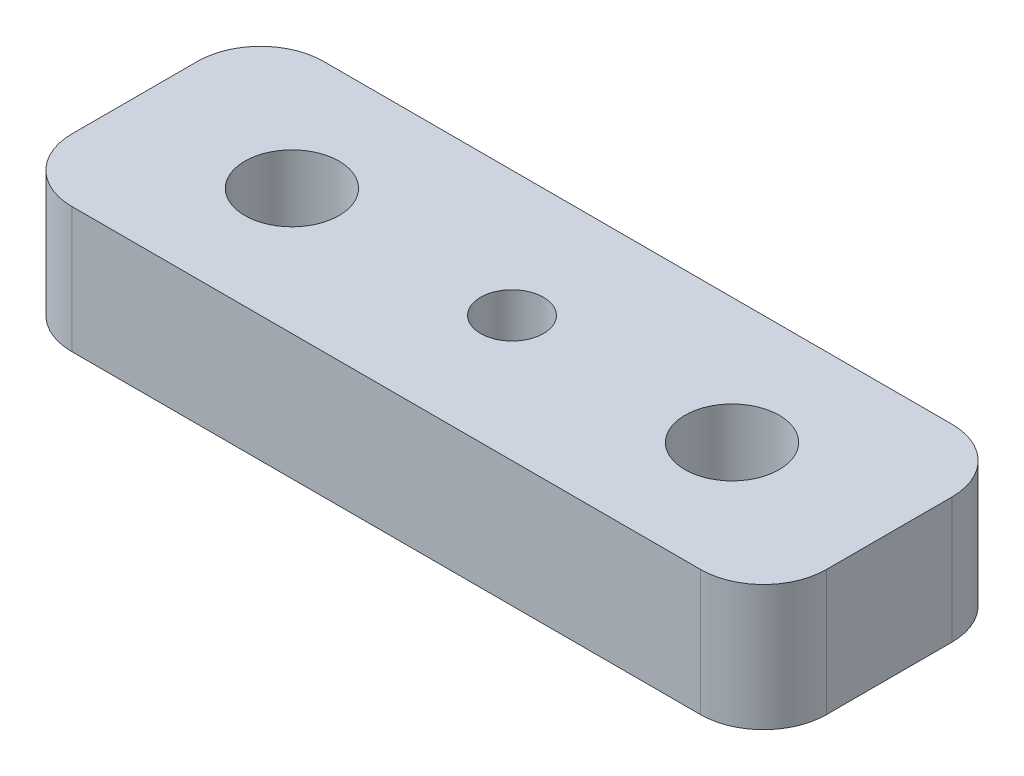
ISO-10303-21;
HEADER;
FILE_DESCRIPTION(('STEP AP214'),'2;1');
FILE_NAME('part.step','',(''),(''),'','','');
FILE_SCHEMA(('AUTOMOTIVE_DESIGN { 1 0 10303 214 1 1 1 1 }'));
ENDSEC;
DATA;
#1=APPLICATION_CONTEXT('core data for automotive mechanical design processes');
#2=APPLICATION_PROTOCOL_DEFINITION('international standard','automotive_design',2000,#1);
#3=PRODUCT_CONTEXT('',#1,'mechanical');
#4=PRODUCT('Part','Part','',(#3));
#5=PRODUCT_RELATED_PRODUCT_CATEGORY('part','',(#4));
#6=PRODUCT_DEFINITION_FORMATION('','',#4);
#7=PRODUCT_DEFINITION_CONTEXT('part definition',#1,'design');
#8=PRODUCT_DEFINITION('design','',#6,#7);
#9=PRODUCT_DEFINITION_SHAPE('','',#8);
#10=(LENGTH_UNIT() NAMED_UNIT(*) SI_UNIT(.MILLI.,.METRE.));
#11=(NAMED_UNIT(*) PLANE_ANGLE_UNIT() SI_UNIT($,.RADIAN.));
#12=(NAMED_UNIT(*) SI_UNIT($,.STERADIAN.) SOLID_ANGLE_UNIT());
#13=UNCERTAINTY_MEASURE_WITH_UNIT(LENGTH_MEASURE(1.E-05),#10,'distance_accuracy_value','');
#14=(GEOMETRIC_REPRESENTATION_CONTEXT(3) GLOBAL_UNCERTAINTY_ASSIGNED_CONTEXT((#13)) GLOBAL_UNIT_ASSIGNED_CONTEXT((#10,
#11,#12)) REPRESENTATION_CONTEXT('',''));
#15=CARTESIAN_POINT('',(0.,0.,0.));
#16=DIRECTION('',(0.,0.,1.));
#17=DIRECTION('',(1.,0.,0.));
#18=AXIS2_PLACEMENT_3D('',#15,#16,#17);
#19=CARTESIAN_POINT('',(-10.,4.,2.));
#20=DIRECTION('',(0.,-1.,0.));
#21=DIRECTION('',(0.,0.,-1.));
#22=AXIS2_PLACEMENT_3D('',#19,#20,#21);
#23=PLANE('',#22);
#24=DIRECTION('',(-1.,0.,0.));
#25=VECTOR('',#24,1.);
#26=CARTESIAN_POINT('',(10.,4.,4.));
#27=LINE('',#26,#25);
#28=CARTESIAN_POINT('',(10.,4.,4.));
#29=VERTEX_POINT('',#28);
#30=CARTESIAN_POINT('',(-10.,4.,4.));
#31=VERTEX_POINT('',#30);
#32=EDGE_CURVE('E88',#29,#31,#27,.T.);
#33=ORIENTED_EDGE('',*,*,#32,.F.);
#34=CARTESIAN_POINT('',(10.,4.,2.));
#35=DIRECTION('',(0.,1.,0.));
#36=DIRECTION('',(0.,0.,1.));
#37=AXIS2_PLACEMENT_3D('',#34,#35,#36);
#38=CIRCLE('',#37,2.);
#39=CARTESIAN_POINT('',(12.,4.,2.));
#40=VERTEX_POINT('',#39);
#41=EDGE_CURVE('E123',#29,#40,#38,.T.);
#42=ORIENTED_EDGE('',*,*,#41,.T.);
#43=DIRECTION('',(0.,0.,1.));
#44=VECTOR('',#43,1.);
#45=CARTESIAN_POINT('',(12.,4.,-2.));
#46=LINE('',#45,#44);
#47=CARTESIAN_POINT('',(12.,4.,-2.));
#48=VERTEX_POINT('',#47);
#49=EDGE_CURVE('E106',#48,#40,#46,.T.);
#50=ORIENTED_EDGE('',*,*,#49,.F.);
#51=CARTESIAN_POINT('',(10.,4.,-2.));
#52=DIRECTION('',(0.,1.,0.));
#53=DIRECTION('',(0.,0.,1.));
#54=AXIS2_PLACEMENT_3D('',#51,#52,#53);
#55=CIRCLE('',#54,2.);
#56=CARTESIAN_POINT('',(10.,4.,-4.));
#57=VERTEX_POINT('',#56);
#58=EDGE_CURVE('E116',#48,#57,#55,.T.);
#59=ORIENTED_EDGE('',*,*,#58,.T.);
#60=DIRECTION('',(1.,0.,0.));
#61=VECTOR('',#60,1.);
#62=CARTESIAN_POINT('',(-10.,4.,-4.));
#63=LINE('',#62,#61);
#64=CARTESIAN_POINT('',(-10.,4.,-4.));
#65=VERTEX_POINT('',#64);
#66=EDGE_CURVE('E120',#65,#57,#63,.T.);
#67=ORIENTED_EDGE('',*,*,#66,.F.);
#68=CARTESIAN_POINT('',(-10.,4.,-2.));
#69=DIRECTION('',(0.,1.,0.));
#70=DIRECTION('',(0.,0.,1.));
#71=AXIS2_PLACEMENT_3D('',#68,#69,#70);
#72=CIRCLE('',#71,2.);
#73=CARTESIAN_POINT('',(-12.,4.,-2.));
#74=VERTEX_POINT('',#73);
#75=EDGE_CURVE('E178',#65,#74,#72,.T.);
#76=ORIENTED_EDGE('',*,*,#75,.T.);
#77=DIRECTION('',(0.,0.,-1.));
#78=VECTOR('',#77,1.);
#79=CARTESIAN_POINT('',(-12.,4.,2.));
#80=LINE('',#79,#78);
#81=CARTESIAN_POINT('',(-12.,4.,2.));
#82=VERTEX_POINT('',#81);
#83=EDGE_CURVE('E171',#82,#74,#80,.T.);
#84=ORIENTED_EDGE('',*,*,#83,.F.);
#85=CARTESIAN_POINT('',(-10.,4.,2.));
#86=DIRECTION('',(0.,-1.,0.));
#87=DIRECTION('',(0.,0.,-1.));
#88=AXIS2_PLACEMENT_3D('',#85,#86,#87);
#89=CIRCLE('',#88,2.);
#90=EDGE_CURVE('E169',#31,#82,#89,.T.);
#91=ORIENTED_EDGE('',*,*,#90,.F.);
#92=EDGE_LOOP('',(#33,#42,#50,#59,#67,#76,#84,#91));
#93=FACE_BOUND('',#92,.T.);
#94=CARTESIAN_POINT('',(0.,4.,0.));
#95=DIRECTION('',(0.,-1.,0.));
#96=DIRECTION('',(0.,0.,-1.));
#97=AXIS2_PLACEMENT_3D('',#94,#95,#96);
#98=CIRCLE('',#97,1.);
#99=CARTESIAN_POINT('',(0.,4.,-1.));
#100=VERTEX_POINT('',#99);
#101=EDGE_CURVE('E131',#100,#100,#98,.T.);
#102=ORIENTED_EDGE('',*,*,#101,.T.);
#103=EDGE_LOOP('',(#102));
#104=FACE_BOUND('',#103,.T.);
#105=CARTESIAN_POINT('',(-7.,4.,0.));
#106=DIRECTION('',(0.,-1.,0.));
#107=DIRECTION('',(0.,0.,-1.));
#108=AXIS2_PLACEMENT_3D('',#105,#106,#107);
#109=CIRCLE('',#108,1.5);
#110=CARTESIAN_POINT('',(-7.,4.,-1.5));
#111=VERTEX_POINT('',#110);
#112=EDGE_CURVE('E312',#111,#111,#109,.T.);
#113=ORIENTED_EDGE('',*,*,#112,.T.);
#114=EDGE_LOOP('',(#113));
#115=FACE_BOUND('',#114,.T.);
#116=CARTESIAN_POINT('',(7.,4.,0.));
#117=DIRECTION('',(0.,-1.,0.));
#118=DIRECTION('',(0.,0.,-1.));
#119=AXIS2_PLACEMENT_3D('',#116,#117,#118);
#120=CIRCLE('',#119,1.5);
#121=CARTESIAN_POINT('',(7.,4.,-1.5));
#122=VERTEX_POINT('',#121);
#123=EDGE_CURVE('E308',#122,#122,#120,.F.);
#124=ORIENTED_EDGE('',*,*,#123,.F.);
#125=EDGE_LOOP('',(#124));
#126=FACE_BOUND('',#125,.T.);
#127=ADVANCED_FACE('F34',(#93,#104,#115,#126),#23,.F.);
#128=CARTESIAN_POINT('',(-10.,0.,2.));
#129=DIRECTION('',(0.,-1.,0.));
#130=DIRECTION('',(0.,0.,-1.));
#131=AXIS2_PLACEMENT_3D('',#128,#129,#130);
#132=PLANE('',#131);
#133=CARTESIAN_POINT('',(0.,0.,0.));
#134=DIRECTION('',(0.,1.,0.));
#135=DIRECTION('',(0.,0.,1.));
#136=AXIS2_PLACEMENT_3D('',#133,#134,#135);
#137=CIRCLE('',#136,2.5);
#138=CARTESIAN_POINT('',(0.,0.,2.5));
#139=VERTEX_POINT('',#138);
#140=EDGE_CURVE('E306',#139,#139,#137,.T.);
#141=ORIENTED_EDGE('',*,*,#140,.T.);
#142=EDGE_LOOP('',(#141));
#143=FACE_BOUND('',#142,.T.);
#144=CARTESIAN_POINT('',(-7.,0.,0.));
#145=DIRECTION('',(0.,1.,0.));
#146=DIRECTION('',(0.,0.,1.));
#147=AXIS2_PLACEMENT_3D('',#144,#145,#146);
#148=CIRCLE('',#147,1.5);
#149=CARTESIAN_POINT('',(-7.,0.,1.5));
#150=VERTEX_POINT('',#149);
#151=EDGE_CURVE('E315',#150,#150,#148,.T.);
#152=ORIENTED_EDGE('',*,*,#151,.T.);
#153=EDGE_LOOP('',(#152));
#154=FACE_BOUND('',#153,.T.);
#155=CARTESIAN_POINT('',(10.,0.,2.));
#156=DIRECTION('',(0.,1.,0.));
#157=DIRECTION('',(0.,0.,1.));
#158=AXIS2_PLACEMENT_3D('',#155,#156,#157);
#159=CIRCLE('',#158,2.);
#160=CARTESIAN_POINT('',(10.,0.,4.));
#161=VERTEX_POINT('',#160);
#162=CARTESIAN_POINT('',(12.,0.,2.));
#163=VERTEX_POINT('',#162);
#164=EDGE_CURVE('E146',#161,#163,#159,.T.);
#165=ORIENTED_EDGE('',*,*,#164,.F.);
#166=DIRECTION('',(-1.,0.,0.));
#167=VECTOR('',#166,1.);
#168=CARTESIAN_POINT('',(0.,0.,4.));
#169=LINE('',#168,#167);
#170=CARTESIAN_POINT('',(-10.,0.,4.));
#171=VERTEX_POINT('',#170);
#172=EDGE_CURVE('E84',#161,#171,#169,.T.);
#173=ORIENTED_EDGE('',*,*,#172,.T.);
#174=CARTESIAN_POINT('',(-10.,0.,2.));
#175=DIRECTION('',(0.,-1.,0.));
#176=DIRECTION('',(0.,0.,-1.));
#177=AXIS2_PLACEMENT_3D('',#174,#175,#176);
#178=CIRCLE('',#177,2.);
#179=CARTESIAN_POINT('',(-12.,0.,2.));
#180=VERTEX_POINT('',#179);
#181=EDGE_CURVE('E130',#171,#180,#178,.T.);
#182=ORIENTED_EDGE('',*,*,#181,.T.);
#183=DIRECTION('',(0.,0.,-1.));
#184=VECTOR('',#183,1.);
#185=CARTESIAN_POINT('',(-12.,0.,2.));
#186=LINE('',#185,#184);
#187=CARTESIAN_POINT('',(-12.,0.,-2.));
#188=VERTEX_POINT('',#187);
#189=EDGE_CURVE('E134',#180,#188,#186,.T.);
#190=ORIENTED_EDGE('',*,*,#189,.T.);
#191=CARTESIAN_POINT('',(-10.,0.,-2.));
#192=DIRECTION('',(0.,1.,0.));
#193=DIRECTION('',(0.,0.,1.));
#194=AXIS2_PLACEMENT_3D('',#191,#192,#193);
#195=CIRCLE('',#194,2.);
#196=CARTESIAN_POINT('',(-10.,0.,-4.));
#197=VERTEX_POINT('',#196);
#198=EDGE_CURVE('E137',#197,#188,#195,.T.);
#199=ORIENTED_EDGE('',*,*,#198,.F.);
#200=DIRECTION('',(1.,0.,0.));
#201=VECTOR('',#200,1.);
#202=CARTESIAN_POINT('',(0.,0.,-4.));
#203=LINE('',#202,#201);
#204=CARTESIAN_POINT('',(10.,0.,-4.));
#205=VERTEX_POINT('',#204);
#206=EDGE_CURVE('E140',#197,#205,#203,.T.);
#207=ORIENTED_EDGE('',*,*,#206,.T.);
#208=CARTESIAN_POINT('',(10.,0.,-2.));
#209=DIRECTION('',(0.,1.,0.));
#210=DIRECTION('',(0.,0.,1.));
#211=AXIS2_PLACEMENT_3D('',#208,#209,#210);
#212=CIRCLE('',#211,2.);
#213=CARTESIAN_POINT('',(12.,0.,-2.));
#214=VERTEX_POINT('',#213);
#215=EDGE_CURVE('E143',#214,#205,#212,.T.);
#216=ORIENTED_EDGE('',*,*,#215,.F.);
#217=DIRECTION('',(0.,0.,1.));
#218=VECTOR('',#217,1.);
#219=CARTESIAN_POINT('',(12.,0.,-2.));
#220=LINE('',#219,#218);
#221=EDGE_CURVE('E108',#214,#163,#220,.T.);
#222=ORIENTED_EDGE('',*,*,#221,.T.);
#223=EDGE_LOOP('',(#165,#173,#182,#190,#199,#207,#216,#222));
#224=FACE_BOUND('',#223,.T.);
#225=CARTESIAN_POINT('',(7.,0.,0.));
#226=DIRECTION('',(0.,-1.,0.));
#227=DIRECTION('',(0.,0.,-1.));
#228=AXIS2_PLACEMENT_3D('',#225,#226,#227);
#229=CIRCLE('',#228,1.5);
#230=CARTESIAN_POINT('',(7.,0.,-1.5));
#231=VERTEX_POINT('',#230);
#232=EDGE_CURVE('E318',#231,#231,#229,.T.);
#233=ORIENTED_EDGE('',*,*,#232,.F.);
#234=EDGE_LOOP('',(#233));
#235=FACE_BOUND('',#234,.T.);
#236=ADVANCED_FACE('F164',(#143,#154,#224,#235),#132,.T.);
#237=CARTESIAN_POINT('',(10.,4.,2.));
#238=DIRECTION('',(0.,-1.,0.));
#239=DIRECTION('',(0.,0.,-1.));
#240=AXIS2_PLACEMENT_3D('',#237,#238,#239);
#241=CYLINDRICAL_SURFACE('',#240,2.);
#242=ORIENTED_EDGE('',*,*,#164,.T.);
#243=DIRECTION('',(0.,-1.,0.));
#244=VECTOR('',#243,1.);
#245=CARTESIAN_POINT('',(12.,4.,2.));
#246=LINE('',#245,#244);
#247=EDGE_CURVE('E44',#40,#163,#246,.T.);
#248=ORIENTED_EDGE('',*,*,#247,.F.);
#249=ORIENTED_EDGE('',*,*,#41,.F.);
#250=DIRECTION('',(0.,-1.,0.));
#251=VECTOR('',#250,1.);
#252=CARTESIAN_POINT('',(10.,4.,4.));
#253=LINE('',#252,#251);
#254=EDGE_CURVE('E11',#29,#161,#253,.T.);
#255=ORIENTED_EDGE('',*,*,#254,.T.);
#256=EDGE_LOOP('',(#242,#248,#249,#255));
#257=FACE_BOUND('',#256,.T.);
#258=ADVANCED_FACE('F167',(#257),#241,.T.);
#259=CARTESIAN_POINT('',(12.,4.,-2.));
#260=DIRECTION('',(1.,0.,0.));
#261=DIRECTION('',(0.,0.,-1.));
#262=AXIS2_PLACEMENT_3D('',#259,#260,#261);
#263=PLANE('',#262);
#264=ORIENTED_EDGE('',*,*,#221,.F.);
#265=DIRECTION('',(0.,-1.,0.));
#266=VECTOR('',#265,1.);
#267=CARTESIAN_POINT('',(12.,4.,-2.));
#268=LINE('',#267,#266);
#269=EDGE_CURVE('E102',#48,#214,#268,.T.);
#270=ORIENTED_EDGE('',*,*,#269,.F.);
#271=ORIENTED_EDGE('',*,*,#49,.T.);
#272=ORIENTED_EDGE('',*,*,#247,.T.);
#273=EDGE_LOOP('',(#264,#270,#271,#272));
#274=FACE_BOUND('',#273,.T.);
#275=ADVANCED_FACE('F104',(#274),#263,.T.);
#276=CARTESIAN_POINT('',(10.,4.,-2.));
#277=DIRECTION('',(0.,-1.,0.));
#278=DIRECTION('',(0.,0.,-1.));
#279=AXIS2_PLACEMENT_3D('',#276,#277,#278);
#280=CYLINDRICAL_SURFACE('',#279,2.);
#281=ORIENTED_EDGE('',*,*,#215,.T.);
#282=DIRECTION('',(0.,-1.,0.));
#283=VECTOR('',#282,1.);
#284=CARTESIAN_POINT('',(10.,4.,-4.));
#285=LINE('',#284,#283);
#286=EDGE_CURVE('E112',#57,#205,#285,.T.);
#287=ORIENTED_EDGE('',*,*,#286,.F.);
#288=ORIENTED_EDGE('',*,*,#58,.F.);
#289=ORIENTED_EDGE('',*,*,#269,.T.);
#290=EDGE_LOOP('',(#281,#287,#288,#289));
#291=FACE_BOUND('',#290,.T.);
#292=ADVANCED_FACE('F117',(#291),#280,.T.);
#293=CARTESIAN_POINT('',(0.,4.,-4.));
#294=DIRECTION('',(0.,0.,-1.));
#295=DIRECTION('',(-1.,0.,0.));
#296=AXIS2_PLACEMENT_3D('',#293,#294,#295);
#297=PLANE('',#296);
#298=ORIENTED_EDGE('',*,*,#206,.F.);
#299=DIRECTION('',(0.,-1.,0.));
#300=VECTOR('',#299,1.);
#301=CARTESIAN_POINT('',(-10.,4.,-4.));
#302=LINE('',#301,#300);
#303=EDGE_CURVE('E150',#65,#197,#302,.T.);
#304=ORIENTED_EDGE('',*,*,#303,.F.);
#305=ORIENTED_EDGE('',*,*,#66,.T.);
#306=ORIENTED_EDGE('',*,*,#286,.T.);
#307=EDGE_LOOP('',(#298,#304,#305,#306));
#308=FACE_BOUND('',#307,.T.);
#309=ADVANCED_FACE('F180',(#308),#297,.T.);
#310=CARTESIAN_POINT('',(-10.,4.,-2.));
#311=DIRECTION('',(0.,-1.,0.));
#312=DIRECTION('',(0.,0.,-1.));
#313=AXIS2_PLACEMENT_3D('',#310,#311,#312);
#314=CYLINDRICAL_SURFACE('',#313,2.);
#315=ORIENTED_EDGE('',*,*,#198,.T.);
#316=DIRECTION('',(0.,-1.,0.));
#317=VECTOR('',#316,1.);
#318=CARTESIAN_POINT('',(-12.,4.,-2.));
#319=LINE('',#318,#317);
#320=EDGE_CURVE('E153',#74,#188,#319,.T.);
#321=ORIENTED_EDGE('',*,*,#320,.F.);
#322=ORIENTED_EDGE('',*,*,#75,.F.);
#323=ORIENTED_EDGE('',*,*,#303,.T.);
#324=EDGE_LOOP('',(#315,#321,#322,#323));
#325=FACE_BOUND('',#324,.T.);
#326=ADVANCED_FACE('F184',(#325),#314,.T.);
#327=CARTESIAN_POINT('',(-12.,4.,2.));
#328=DIRECTION('',(-1.,0.,0.));
#329=DIRECTION('',(0.,0.,1.));
#330=AXIS2_PLACEMENT_3D('',#327,#328,#329);
#331=PLANE('',#330);
#332=ORIENTED_EDGE('',*,*,#189,.F.);
#333=DIRECTION('',(0.,-1.,0.));
#334=VECTOR('',#333,1.);
#335=CARTESIAN_POINT('',(-12.,4.,2.));
#336=LINE('',#335,#334);
#337=EDGE_CURVE('E155',#82,#180,#336,.T.);
#338=ORIENTED_EDGE('',*,*,#337,.F.);
#339=ORIENTED_EDGE('',*,*,#83,.T.);
#340=ORIENTED_EDGE('',*,*,#320,.T.);
#341=EDGE_LOOP('',(#332,#338,#339,#340));
#342=FACE_BOUND('',#341,.T.);
#343=ADVANCED_FACE('F187',(#342),#331,.T.);
#344=CARTESIAN_POINT('',(-10.,4.,2.));
#345=DIRECTION('',(0.,-1.,0.));
#346=DIRECTION('',(0.,0.,-1.));
#347=AXIS2_PLACEMENT_3D('',#344,#345,#346);
#348=CYLINDRICAL_SURFACE('',#347,2.);
#349=ORIENTED_EDGE('',*,*,#181,.F.);
#350=DIRECTION('',(0.,-1.,0.));
#351=VECTOR('',#350,1.);
#352=CARTESIAN_POINT('',(-10.,4.,4.));
#353=LINE('',#352,#351);
#354=EDGE_CURVE('E125',#31,#171,#353,.T.);
#355=ORIENTED_EDGE('',*,*,#354,.F.);
#356=ORIENTED_EDGE('',*,*,#90,.T.);
#357=ORIENTED_EDGE('',*,*,#337,.T.);
#358=EDGE_LOOP('',(#349,#355,#356,#357));
#359=FACE_BOUND('',#358,.T.);
#360=ADVANCED_FACE('F160',(#359),#348,.T.);
#361=CARTESIAN_POINT('',(0.,4.,4.));
#362=DIRECTION('',(0.,0.,1.));
#363=DIRECTION('',(1.,0.,0.));
#364=AXIS2_PLACEMENT_3D('',#361,#362,#363);
#365=PLANE('',#364);
#366=ORIENTED_EDGE('',*,*,#172,.F.);
#367=ORIENTED_EDGE('',*,*,#254,.F.);
#368=ORIENTED_EDGE('',*,*,#32,.T.);
#369=ORIENTED_EDGE('',*,*,#354,.T.);
#370=EDGE_LOOP('',(#366,#367,#368,#369));
#371=FACE_BOUND('',#370,.T.);
#372=ADVANCED_FACE('F36',(#371),#365,.T.);
#373=CARTESIAN_POINT('',(0.,4.001,0.));
#374=DIRECTION('',(0.,-1.,0.));
#375=DIRECTION('',(0.,0.,-1.));
#376=AXIS2_PLACEMENT_3D('',#373,#374,#375);
#377=CYLINDRICAL_SURFACE('',#376,1.);
#378=CARTESIAN_POINT('',(0.,2.,0.));
#379=DIRECTION('',(0.,1.,0.));
#380=DIRECTION('',(0.,0.,1.));
#381=AXIS2_PLACEMENT_3D('',#378,#379,#380);
#382=CIRCLE('',#381,1.);
#383=CARTESIAN_POINT('',(0.,2.,1.));
#384=VERTEX_POINT('',#383);
#385=EDGE_CURVE('E38',#384,#384,#382,.T.);
#386=ORIENTED_EDGE('',*,*,#385,.F.);
#387=EDGE_LOOP('',(#386));
#388=FACE_BOUND('',#387,.T.);
#389=ORIENTED_EDGE('',*,*,#101,.F.);
#390=EDGE_LOOP('',(#389));
#391=FACE_BOUND('',#390,.T.);
#392=ADVANCED_FACE('F203',(#388,#391),#377,.F.);
#393=CARTESIAN_POINT('',(-7.,4.001,0.));
#394=DIRECTION('',(0.,-1.,0.));
#395=DIRECTION('',(0.,0.,-1.));
#396=AXIS2_PLACEMENT_3D('',#393,#394,#395);
#397=CYLINDRICAL_SURFACE('',#396,1.5);
#398=ORIENTED_EDGE('',*,*,#151,.F.);
#399=EDGE_LOOP('',(#398));
#400=FACE_BOUND('',#399,.T.);
#401=ORIENTED_EDGE('',*,*,#112,.F.);
#402=EDGE_LOOP('',(#401));
#403=FACE_BOUND('',#402,.T.);
#404=ADVANCED_FACE('F251',(#400,#403),#397,.F.);
#405=CARTESIAN_POINT('',(7.,4.001,0.));
#406=DIRECTION('',(0.,-1.,0.));
#407=DIRECTION('',(0.,0.,-1.));
#408=AXIS2_PLACEMENT_3D('',#405,#406,#407);
#409=CYLINDRICAL_SURFACE('',#408,1.5);
#410=ORIENTED_EDGE('',*,*,#232,.T.);
#411=EDGE_LOOP('',(#410));
#412=FACE_BOUND('',#411,.T.);
#413=ORIENTED_EDGE('',*,*,#123,.T.);
#414=EDGE_LOOP('',(#413));
#415=FACE_BOUND('',#414,.T.);
#416=ADVANCED_FACE('F256',(#412,#415),#409,.F.);
#417=CARTESIAN_POINT('',(0.,2.,0.));
#418=DIRECTION('',(0.,-1.,0.));
#419=DIRECTION('',(0.,0.,-1.));
#420=AXIS2_PLACEMENT_3D('',#417,#418,#419);
#421=CYLINDRICAL_SURFACE('',#420,2.5);
#422=CARTESIAN_POINT('',(0.,2.,0.));
#423=DIRECTION('',(0.,1.,0.));
#424=DIRECTION('',(0.,0.,1.));
#425=AXIS2_PLACEMENT_3D('',#422,#423,#424);
#426=CIRCLE('',#425,2.5);
#427=CARTESIAN_POINT('',(0.,2.,2.5));
#428=VERTEX_POINT('',#427);
#429=EDGE_CURVE('E305',#428,#428,#426,.T.);
#430=ORIENTED_EDGE('',*,*,#429,.T.);
#431=EDGE_LOOP('',(#430));
#432=FACE_BOUND('',#431,.T.);
#433=ORIENTED_EDGE('',*,*,#140,.F.);
#434=EDGE_LOOP('',(#433));
#435=FACE_BOUND('',#434,.T.);
#436=ADVANCED_FACE('F266',(#432,#435),#421,.F.);
#437=CARTESIAN_POINT('',(0.,2.,0.));
#438=DIRECTION('',(0.,1.,0.));
#439=DIRECTION('',(0.,0.,1.));
#440=AXIS2_PLACEMENT_3D('',#437,#438,#439);
#441=PLANE('',#440);
#442=ORIENTED_EDGE('',*,*,#385,.T.);
#443=EDGE_LOOP('',(#442));
#444=FACE_BOUND('',#443,.T.);
#445=ORIENTED_EDGE('',*,*,#429,.F.);
#446=EDGE_LOOP('',(#445));
#447=FACE_BOUND('',#446,.T.);
#448=ADVANCED_FACE('F286',(#444,#447),#441,.F.);
#449=CLOSED_SHELL('',(#127,#236,#258,#275,#292,#309,#326,#343,#360,#372,#392,#404,#416,#436,#448));
#450=MANIFOLD_SOLID_BREP('B2',#449);
#451=ADVANCED_BREP_SHAPE_REPRESENTATION('',(#18,#450),#14);
#452=SHAPE_DEFINITION_REPRESENTATION(#9,#451);
ENDSEC;
END-ISO-10303-21;
